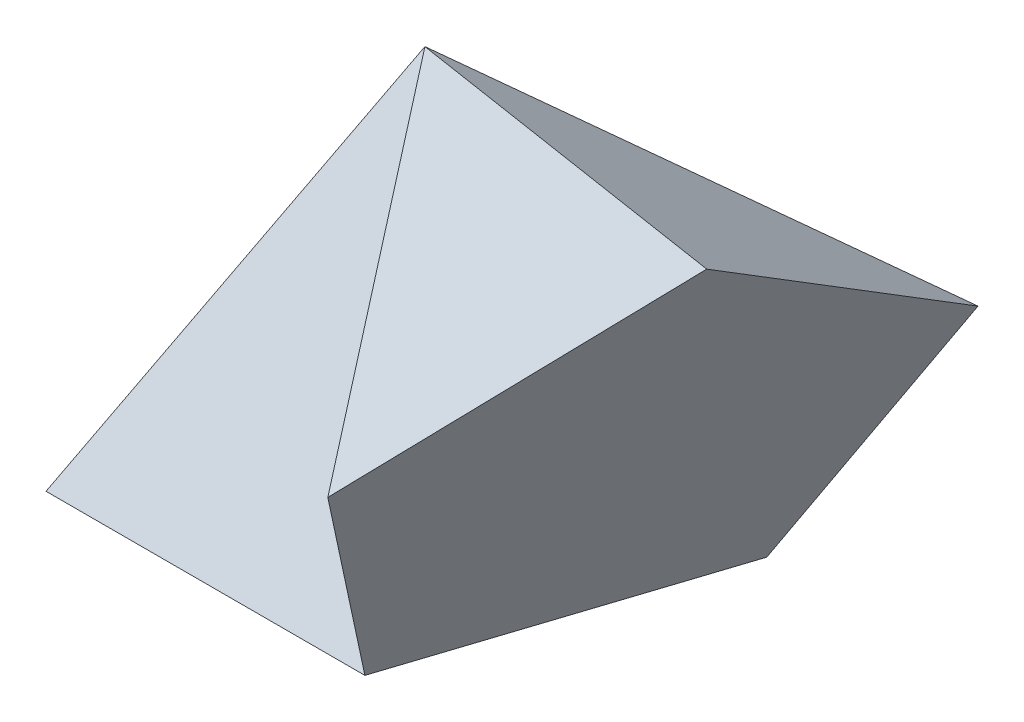
ISO-10303-21;
HEADER;
FILE_DESCRIPTION(('STEP AP214'),'2;1');
FILE_NAME('part.step','',(''),(''),'','','');
FILE_SCHEMA(('AUTOMOTIVE_DESIGN { 1 0 10303 214 1 1 1 1 }'));
ENDSEC;
DATA;
#1=APPLICATION_CONTEXT('core data for automotive mechanical design processes');
#2=APPLICATION_PROTOCOL_DEFINITION('international standard','automotive_design',2000,#1);
#3=PRODUCT_CONTEXT('',#1,'mechanical');
#4=PRODUCT('Part','Part','',(#3));
#5=PRODUCT_RELATED_PRODUCT_CATEGORY('part','',(#4));
#6=PRODUCT_DEFINITION_FORMATION('','',#4);
#7=PRODUCT_DEFINITION_CONTEXT('part definition',#1,'design');
#8=PRODUCT_DEFINITION('design','',#6,#7);
#9=PRODUCT_DEFINITION_SHAPE('','',#8);
#10=(LENGTH_UNIT() NAMED_UNIT(*) SI_UNIT(.MILLI.,.METRE.));
#11=(NAMED_UNIT(*) PLANE_ANGLE_UNIT() SI_UNIT($,.RADIAN.));
#12=(NAMED_UNIT(*) SI_UNIT($,.STERADIAN.) SOLID_ANGLE_UNIT());
#13=UNCERTAINTY_MEASURE_WITH_UNIT(LENGTH_MEASURE(1.E-05),#10,'distance_accuracy_value','');
#14=(GEOMETRIC_REPRESENTATION_CONTEXT(3) GLOBAL_UNCERTAINTY_ASSIGNED_CONTEXT((#13)) GLOBAL_UNIT_ASSIGNED_CONTEXT((#10,
#11,#12)) REPRESENTATION_CONTEXT('',''));
#15=CARTESIAN_POINT('',(0.,0.,0.));
#16=DIRECTION('',(0.,0.,1.));
#17=DIRECTION('',(1.,0.,0.));
#18=AXIS2_PLACEMENT_3D('',#15,#16,#17);
#19=CARTESIAN_POINT('',(10.2745158285618,0.,-3.33839256195651));
#20=DIRECTION('',(0.499999999999999,0.525731112119135,-0.688190960235587));
#21=DIRECTION('',(0.,0.794654472291766,0.607061998206687));
#22=AXIS2_PLACEMENT_3D('',#19,#20,#21);
#23=PLANE('',#22);
#24=DIRECTION('',(-0.809016994374948,0.,-0.587785252292472));
#25=VECTOR('',#24,1.);
#26=CARTESIAN_POINT('',(10.2745158285618,0.,-3.33839256195651));
#27=LINE('',#26,#25);
#28=CARTESIAN_POINT('',(10.2745158285618,0.,-3.33839256195651));
#29=VERTEX_POINT('',#28);
#30=CARTESIAN_POINT('',(0.,0.,-10.8032652660709));
#31=VERTEX_POINT('',#30);
#32=EDGE_CURVE('E85',#29,#31,#27,.T.);
#33=ORIENTED_EDGE('',*,*,#32,.T.);
#34=DIRECTION('',(0.,-0.794654472291765,-0.607061998206687));
#35=VECTOR('',#34,1.);
#36=CARTESIAN_POINT('',(0.,0.,-10.8032652660709));
#37=LINE('',#36,#35);
#38=CARTESIAN_POINT('',(0.,14.1416578280274,0.));
#39=VERTEX_POINT('',#38);
#40=EDGE_CURVE('E11',#39,#31,#37,.T.);
#41=ORIENTED_EDGE('',*,*,#40,.F.);
#42=DIRECTION('',(0.577350269189626,-0.794654472291765,-0.187592474085081));
#43=VECTOR('',#42,1.);
#44=CARTESIAN_POINT('',(10.2745158285618,0.,-3.33839256195651));
#45=LINE('',#44,#43);
#46=EDGE_CURVE('E56',#39,#29,#45,.T.);
#47=ORIENTED_EDGE('',*,*,#46,.T.);
#48=EDGE_LOOP('',(#33,#41,#47));
#49=FACE_BOUND('',#48,.T.);
#50=ADVANCED_FACE('F34',(#49),#23,.T.);
#51=CARTESIAN_POINT('',(0.,0.,-10.8032652660709));
#52=DIRECTION('',(-0.500000000000001,0.525731112119135,-0.688190960235585));
#53=DIRECTION('',(0.,0.794654472291765,0.607061998206688));
#54=AXIS2_PLACEMENT_3D('',#51,#52,#53);
#55=PLANE('',#54);
#56=DIRECTION('',(-0.809016994374946,0.,0.587785252292474));
#57=VECTOR('',#56,1.);
#58=CARTESIAN_POINT('',(0.,0.,-10.8032652660709));
#59=LINE('',#58,#57);
#60=CARTESIAN_POINT('',(-10.2745158285618,0.,-3.33839256195648));
#61=VERTEX_POINT('',#60);
#62=EDGE_CURVE('E126',#31,#61,#59,.T.);
#63=ORIENTED_EDGE('',*,*,#62,.T.);
#64=DIRECTION('',(-0.577350269189627,-0.794654472291765,-0.187592474085079));
#65=VECTOR('',#64,1.);
#66=CARTESIAN_POINT('',(-10.2745158285618,0.,-3.33839256195648));
#67=LINE('',#66,#65);
#68=EDGE_CURVE('E38',#39,#61,#67,.T.);
#69=ORIENTED_EDGE('',*,*,#68,.F.);
#70=ORIENTED_EDGE('',*,*,#40,.T.);
#71=EDGE_LOOP('',(#63,#69,#70));
#72=FACE_BOUND('',#71,.T.);
#73=ADVANCED_FACE('F36',(#72),#55,.T.);
#74=CARTESIAN_POINT('',(-10.2745158285618,0.,-3.33839256195648));
#75=DIRECTION('',(-0.809016994374947,0.525731112119135,0.262865556059568));
#76=DIRECTION('',(-0.544893675596393,-0.838505147446963,0.));
#77=AXIS2_PLACEMENT_3D('',#74,#75,#76);
#78=PLANE('',#77);
#79=DIRECTION('',(0.309016994374949,0.,0.951056516295153));
#80=VECTOR('',#79,1.);
#81=CARTESIAN_POINT('',(-10.2745158285618,0.,-3.33839256195648));
#82=LINE('',#81,#80);
#83=CARTESIAN_POINT('',(-6.34999999999999,0.,8.74002519499197));
#84=VERTEX_POINT('',#83);
#85=EDGE_CURVE('E98',#61,#84,#82,.T.);
#86=ORIENTED_EDGE('',*,*,#85,.T.);
#87=DIRECTION('',(-0.35682208977309,-0.794654472291765,0.491123473188424));
#88=VECTOR('',#87,1.);
#89=CARTESIAN_POINT('',(-6.34999999999999,0.,8.74002519499197));
#90=LINE('',#89,#88);
#91=EDGE_CURVE('E96',#39,#84,#90,.T.);
#92=ORIENTED_EDGE('',*,*,#91,.F.);
#93=ORIENTED_EDGE('',*,*,#68,.T.);
#94=EDGE_LOOP('',(#86,#92,#93));
#95=FACE_BOUND('',#94,.T.);
#96=ADVANCED_FACE('F130',(#95),#78,.T.);
#97=CARTESIAN_POINT('',(-6.34999999999999,0.,8.74002519499197));
#98=DIRECTION('',(0.,0.525731112119135,0.850650808352039));
#99=DIRECTION('',(0.,-0.850650808352039,0.525731112119135));
#100=AXIS2_PLACEMENT_3D('',#97,#98,#99);
#101=PLANE('',#100);
#102=DIRECTION('',(1.,0.,0.));
#103=VECTOR('',#102,1.);
#104=CARTESIAN_POINT('',(-6.34999999999999,0.,8.74002519499197));
#105=LINE('',#104,#103);
#106=CARTESIAN_POINT('',(6.35000000000002,0.,8.74002519499195));
#107=VERTEX_POINT('',#106);
#108=EDGE_CURVE('E84',#84,#107,#105,.T.);
#109=ORIENTED_EDGE('',*,*,#108,.T.);
#110=DIRECTION('',(0.356822089773091,-0.794654472291765,0.491123473188423));
#111=VECTOR('',#110,1.);
#112=CARTESIAN_POINT('',(6.35000000000002,0.,8.74002519499195));
#113=LINE('',#112,#111);
#114=EDGE_CURVE('E95',#39,#107,#113,.T.);
#115=ORIENTED_EDGE('',*,*,#114,.F.);
#116=ORIENTED_EDGE('',*,*,#91,.T.);
#117=EDGE_LOOP('',(#109,#115,#116));
#118=FACE_BOUND('',#117,.T.);
#119=ADVANCED_FACE('F94',(#118),#101,.T.);
#120=CARTESIAN_POINT('',(0.,0.,0.));
#121=DIRECTION('',(0.,1.,0.));
#122=DIRECTION('',(0.,0.,1.));
#123=AXIS2_PLACEMENT_3D('',#120,#121,#122);
#124=PLANE('',#123);
#125=ORIENTED_EDGE('',*,*,#32,.F.);
#126=DIRECTION('',(0.309016994374946,0.,-0.951056516295154));
#127=VECTOR('',#126,1.);
#128=CARTESIAN_POINT('',(6.35000000000002,0.,8.74002519499195));
#129=LINE('',#128,#127);
#130=EDGE_CURVE('E80',#107,#29,#129,.T.);
#131=ORIENTED_EDGE('',*,*,#130,.F.);
#132=ORIENTED_EDGE('',*,*,#108,.F.);
#133=ORIENTED_EDGE('',*,*,#85,.F.);
#134=ORIENTED_EDGE('',*,*,#62,.F.);
#135=EDGE_LOOP('',(#125,#131,#132,#133,#134));
#136=FACE_BOUND('',#135,.T.);
#137=ADVANCED_FACE('F82',(#136),#124,.F.);
#138=CARTESIAN_POINT('',(10.2745158285618,0.,-3.33839256195651));
#139=DIRECTION('',(-0.30901699437495,0.,-0.951056516295153));
#140=DIRECTION('',(-0.951056516295153,0.,0.30901699437495));
#141=AXIS2_PLACEMENT_3D('',#138,#139,#140);
#142=PLANE('',#141);
#143=DIRECTION('',(0.499999999999998,0.850650808352041,-0.162459848116455));
#144=VECTOR('',#143,1.);
#145=CARTESIAN_POINT('',(10.2745158285618,0.,-3.33839256195651));
#146=LINE('',#145,#144);
#147=CARTESIAN_POINT('',(16.6245158285618,10.8032652660709,-5.40163263303549));
#148=VERTEX_POINT('',#147);
#149=EDGE_CURVE('E113',#29,#148,#146,.T.);
#150=ORIENTED_EDGE('',*,*,#149,.F.);
#151=ORIENTED_EDGE('',*,*,#46,.F.);
#152=DIRECTION('',(0.934172358962715,-0.187592474085077,-0.303530999103346));
#153=VECTOR('',#152,1.);
#154=CARTESIAN_POINT('',(12.3911824952285,11.6533669266559,-4.02613925231617));
#155=LINE('',#154,#153);
#156=EDGE_CURVE('E120',#39,#148,#155,.T.);
#157=ORIENTED_EDGE('',*,*,#156,.T.);
#158=EDGE_LOOP('',(#150,#151,#157));
#159=FACE_BOUND('',#158,.T.);
#160=ADVANCED_FACE('F156',(#159),#142,.T.);
#161=CARTESIAN_POINT('',(10.2745158285618,10.8032652660709,14.1416578280274));
#162=DIRECTION('',(-0.809016994374947,0.,0.587785252292473));
#163=DIRECTION('',(0.587785252292473,0.,0.809016994374947));
#164=AXIS2_PLACEMENT_3D('',#161,#162,#163);
#165=PLANE('',#164);
#166=DIRECTION('',(-0.309016994374946,-0.850650808352041,-0.425325404176019));
#167=VECTOR('',#166,1.);
#168=CARTESIAN_POINT('',(10.2745158285618,10.8032652660709,14.1416578280274));
#169=LINE('',#168,#167);
#170=CARTESIAN_POINT('',(10.2745158285618,10.8032652660709,14.1416578280274));
#171=VERTEX_POINT('',#170);
#172=EDGE_CURVE('E104',#171,#107,#169,.T.);
#173=ORIENTED_EDGE('',*,*,#172,.F.);
#174=DIRECTION('',(0.577350269189626,-0.187592474085078,0.794654472291766));
#175=VECTOR('',#174,1.);
#176=CARTESIAN_POINT('',(7.65817194285393,11.6533669266559,10.5405694060037));
#177=LINE('',#176,#175);
#178=EDGE_CURVE('E106',#39,#171,#177,.T.);
#179=ORIENTED_EDGE('',*,*,#178,.F.);
#180=ORIENTED_EDGE('',*,*,#114,.T.);
#181=EDGE_LOOP('',(#173,#179,#180));
#182=FACE_BOUND('',#181,.T.);
#183=ADVANCED_FACE('F103',(#182),#165,.T.);
#184=CARTESIAN_POINT('',(16.6245158285618,17.4800503899839,5.40163263303542));
#185=DIRECTION('',(-0.309016994374949,0.85065080835204,0.425325404176019));
#186=DIRECTION('',(0.,-0.447213595499957,0.894427190999916));
#187=AXIS2_PLACEMENT_3D('',#184,#185,#186);
#188=PLANE('',#187);
#189=DIRECTION('',(-0.499999999999998,-0.525731112119134,0.688190960235588));
#190=VECTOR('',#189,1.);
#191=CARTESIAN_POINT('',(16.6245158285618,17.4800503899839,5.40163263303542));
#192=LINE('',#191,#190);
#193=CARTESIAN_POINT('',(16.6245158285618,17.4800503899839,5.40163263303542));
#194=VERTEX_POINT('',#193);
#195=EDGE_CURVE('E112',#194,#171,#192,.T.);
#196=ORIENTED_EDGE('',*,*,#195,.F.);
#197=DIRECTION('',(0.934172358962715,0.187592474085083,0.303530999103341));
#198=VECTOR('',#197,1.);
#199=CARTESIAN_POINT('',(12.3911824952285,16.6299487293989,4.02613925231612));
#200=LINE('',#199,#198);
#201=EDGE_CURVE('E122',#39,#194,#200,.T.);
#202=ORIENTED_EDGE('',*,*,#201,.F.);
#203=ORIENTED_EDGE('',*,*,#178,.T.);
#204=EDGE_LOOP('',(#196,#202,#203));
#205=FACE_BOUND('',#204,.T.);
#206=ADVANCED_FACE('F169',(#205),#188,.T.);
#207=CARTESIAN_POINT('',(16.6245158285618,10.8032652660709,-5.40163263303549));
#208=DIRECTION('',(0.,0.85065080835204,-0.525731112119134));
#209=DIRECTION('',(0.,0.525731112119134,0.85065080835204));
#210=AXIS2_PLACEMENT_3D('',#207,#208,#209);
#211=PLANE('',#210);
#212=DIRECTION('',(0.,0.525731112119134,0.85065080835204));
#213=VECTOR('',#212,1.);
#214=CARTESIAN_POINT('',(16.6245158285618,10.8032652660709,-5.40163263303549));
#215=LINE('',#214,#213);
#216=EDGE_CURVE('E115',#148,#194,#215,.T.);
#217=ORIENTED_EDGE('',*,*,#216,.F.);
#218=ORIENTED_EDGE('',*,*,#156,.F.);
#219=ORIENTED_EDGE('',*,*,#201,.T.);
#220=EDGE_LOOP('',(#217,#218,#219));
#221=FACE_BOUND('',#220,.T.);
#222=ADVANCED_FACE('F175',(#221),#211,.T.);
#223=CARTESIAN_POINT('',(12.0296126628495,7.81731618442516,3.90865809221255));
#224=DIRECTION('',(-0.850650808352041,0.447213595499956,-0.27639320225002));
#225=DIRECTION('',(-0.425325404176017,-0.27639320225002,0.861803398874991));
#226=AXIS2_PLACEMENT_3D('',#223,#224,#225);
#227=PLANE('',#226);
#228=ORIENTED_EDGE('',*,*,#149,.T.);
#229=ORIENTED_EDGE('',*,*,#216,.T.);
#230=ORIENTED_EDGE('',*,*,#195,.T.);
#231=ORIENTED_EDGE('',*,*,#172,.T.);
#232=ORIENTED_EDGE('',*,*,#130,.T.);
#233=EDGE_LOOP('',(#228,#229,#230,#231,#232));
#234=FACE_BOUND('',#233,.T.);
#235=ADVANCED_FACE('F109',(#234),#227,.F.);
#236=CLOSED_SHELL('',(#50,#73,#96,#119,#137,#160,#183,#206,#222,#235));
#237=MANIFOLD_SOLID_BREP('B2',#236);
#238=ADVANCED_BREP_SHAPE_REPRESENTATION('',(#18,#237),#14);
#239=SHAPE_DEFINITION_REPRESENTATION(#9,#238);
ENDSEC;
END-ISO-10303-21;
